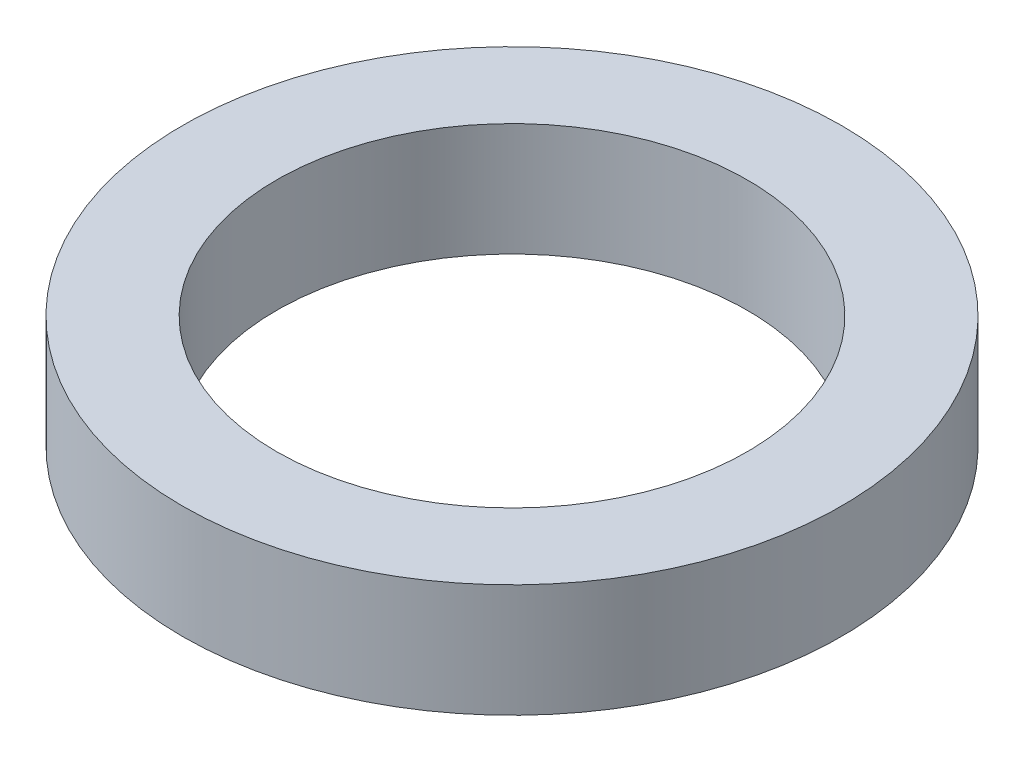
ISO-10303-21;
HEADER;
FILE_DESCRIPTION(('STEP AP214'),'2;1');
FILE_NAME('part.step','',(''),(''),'','','');
FILE_SCHEMA(('AUTOMOTIVE_DESIGN { 1 0 10303 214 1 1 1 1 }'));
ENDSEC;
DATA;
#1=APPLICATION_CONTEXT('core data for automotive mechanical design processes');
#2=APPLICATION_PROTOCOL_DEFINITION('international standard','automotive_design',2000,#1);
#3=PRODUCT_CONTEXT('',#1,'mechanical');
#4=PRODUCT('Part','Part','',(#3));
#5=PRODUCT_RELATED_PRODUCT_CATEGORY('part','',(#4));
#6=PRODUCT_DEFINITION_FORMATION('','',#4);
#7=PRODUCT_DEFINITION_CONTEXT('part definition',#1,'design');
#8=PRODUCT_DEFINITION('design','',#6,#7);
#9=PRODUCT_DEFINITION_SHAPE('','',#8);
#10=(LENGTH_UNIT() NAMED_UNIT(*) SI_UNIT(.MILLI.,.METRE.));
#11=(NAMED_UNIT(*) PLANE_ANGLE_UNIT() SI_UNIT($,.RADIAN.));
#12=(NAMED_UNIT(*) SI_UNIT($,.STERADIAN.) SOLID_ANGLE_UNIT());
#13=UNCERTAINTY_MEASURE_WITH_UNIT(LENGTH_MEASURE(1.E-05),#10,'distance_accuracy_value','');
#14=(GEOMETRIC_REPRESENTATION_CONTEXT(3) GLOBAL_UNCERTAINTY_ASSIGNED_CONTEXT((#13)) GLOBAL_UNIT_ASSIGNED_CONTEXT((#10,
#11,#12)) REPRESENTATION_CONTEXT('',''));
#15=CARTESIAN_POINT('',(0.,0.,0.));
#16=DIRECTION('',(0.,0.,1.));
#17=DIRECTION('',(1.,0.,0.));
#18=AXIS2_PLACEMENT_3D('',#15,#16,#17);
#19=CARTESIAN_POINT('',(0.,24.,0.));
#20=DIRECTION('',(0.,-1.,0.));
#21=DIRECTION('',(0.,0.,-1.));
#22=AXIS2_PLACEMENT_3D('',#19,#20,#21);
#23=CYLINDRICAL_SURFACE('',#22,70.);
#24=CARTESIAN_POINT('',(0.,24.,0.));
#25=DIRECTION('',(0.,1.,0.));
#26=DIRECTION('',(0.,0.,1.));
#27=AXIS2_PLACEMENT_3D('',#24,#25,#26);
#28=CIRCLE('',#27,70.);
#29=CARTESIAN_POINT('',(0.,24.,70.));
#30=VERTEX_POINT('',#29);
#31=EDGE_CURVE('E10',#30,#30,#28,.T.);
#32=ORIENTED_EDGE('',*,*,#31,.F.);
#33=EDGE_LOOP('',(#32));
#34=FACE_BOUND('',#33,.T.);
#35=CARTESIAN_POINT('',(0.,0.,0.));
#36=DIRECTION('',(0.,1.,0.));
#37=DIRECTION('',(0.,0.,1.));
#38=AXIS2_PLACEMENT_3D('',#35,#36,#37);
#39=CIRCLE('',#38,70.);
#40=CARTESIAN_POINT('',(0.,0.,70.));
#41=VERTEX_POINT('',#40);
#42=EDGE_CURVE('E37',#41,#41,#39,.T.);
#43=ORIENTED_EDGE('',*,*,#42,.T.);
#44=EDGE_LOOP('',(#43));
#45=FACE_BOUND('',#44,.T.);
#46=ADVANCED_FACE('F40',(#34,#45),#23,.T.);
#47=CARTESIAN_POINT('',(0.,24.,0.));
#48=DIRECTION('',(0.,1.,0.));
#49=DIRECTION('',(0.,0.,1.));
#50=AXIS2_PLACEMENT_3D('',#47,#48,#49);
#51=PLANE('',#50);
#52=CARTESIAN_POINT('',(0.,24.,0.));
#53=DIRECTION('',(0.,1.,0.));
#54=DIRECTION('',(0.,0.,1.));
#55=AXIS2_PLACEMENT_3D('',#52,#53,#54);
#56=CIRCLE('',#55,50.);
#57=CARTESIAN_POINT('',(0.,24.,50.));
#58=VERTEX_POINT('',#57);
#59=EDGE_CURVE('E50',#58,#58,#56,.T.);
#60=ORIENTED_EDGE('',*,*,#59,.F.);
#61=EDGE_LOOP('',(#60));
#62=FACE_BOUND('',#61,.T.);
#63=ORIENTED_EDGE('',*,*,#31,.T.);
#64=EDGE_LOOP('',(#63));
#65=FACE_BOUND('',#64,.T.);
#66=ADVANCED_FACE('F59',(#62,#65),#51,.T.);
#67=CARTESIAN_POINT('',(0.,0.,0.));
#68=DIRECTION('',(0.,1.,0.));
#69=DIRECTION('',(0.,0.,1.));
#70=AXIS2_PLACEMENT_3D('',#67,#68,#69);
#71=PLANE('',#70);
#72=CARTESIAN_POINT('',(0.,0.,0.));
#73=DIRECTION('',(0.,1.,0.));
#74=DIRECTION('',(0.,0.,1.));
#75=AXIS2_PLACEMENT_3D('',#72,#73,#74);
#76=CIRCLE('',#75,50.);
#77=CARTESIAN_POINT('',(0.,0.,50.));
#78=VERTEX_POINT('',#77);
#79=EDGE_CURVE('E47',#78,#78,#76,.T.);
#80=ORIENTED_EDGE('',*,*,#79,.T.);
#81=EDGE_LOOP('',(#80));
#82=FACE_BOUND('',#81,.T.);
#83=ORIENTED_EDGE('',*,*,#42,.F.);
#84=EDGE_LOOP('',(#83));
#85=FACE_BOUND('',#84,.T.);
#86=ADVANCED_FACE('F58',(#82,#85),#71,.F.);
#87=CARTESIAN_POINT('',(0.,24.,0.));
#88=DIRECTION('',(0.,-1.,0.));
#89=DIRECTION('',(0.,0.,-1.));
#90=AXIS2_PLACEMENT_3D('',#87,#88,#89);
#91=CYLINDRICAL_SURFACE('',#90,50.);
#92=ORIENTED_EDGE('',*,*,#59,.T.);
#93=EDGE_LOOP('',(#92));
#94=FACE_BOUND('',#93,.T.);
#95=ORIENTED_EDGE('',*,*,#79,.F.);
#96=EDGE_LOOP('',(#95));
#97=FACE_BOUND('',#96,.T.);
#98=ADVANCED_FACE('F54',(#94,#97),#91,.F.);
#99=CLOSED_SHELL('',(#46,#66,#86,#98));
#100=MANIFOLD_SOLID_BREP('B2',#99);
#101=ADVANCED_BREP_SHAPE_REPRESENTATION('',(#18,#100),#14);
#102=SHAPE_DEFINITION_REPRESENTATION(#9,#101);
ENDSEC;
END-ISO-10303-21;
